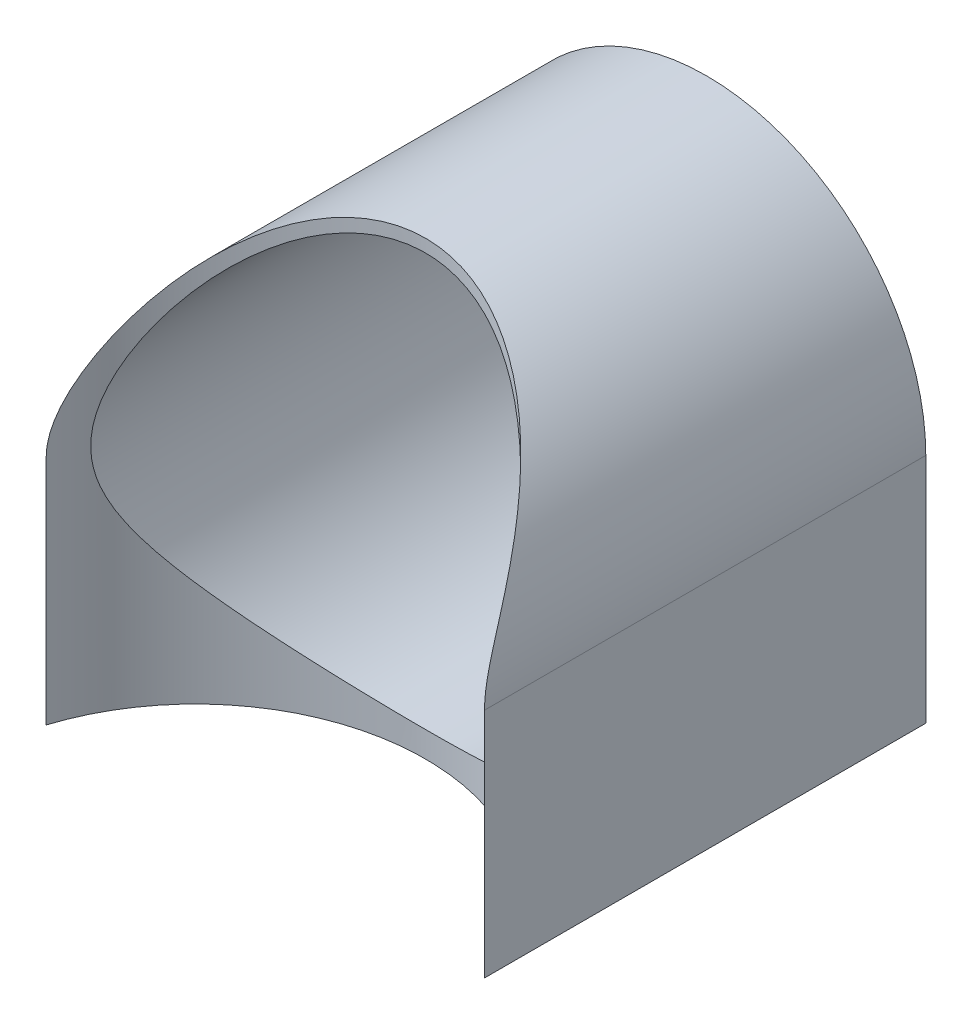
ISO-10303-21;
HEADER;
FILE_DESCRIPTION(('STEP AP214'),'2;1');
FILE_NAME('part.step','',(''),(''),'','','');
FILE_SCHEMA(('AUTOMOTIVE_DESIGN { 1 0 10303 214 1 1 1 1 }'));
ENDSEC;
DATA;
#1=APPLICATION_CONTEXT('core data for automotive mechanical design processes');
#2=APPLICATION_PROTOCOL_DEFINITION('international standard','automotive_design',2000,#1);
#3=PRODUCT_CONTEXT('',#1,'mechanical');
#4=PRODUCT('Part','Part','',(#3));
#5=PRODUCT_RELATED_PRODUCT_CATEGORY('part','',(#4));
#6=PRODUCT_DEFINITION_FORMATION('','',#4);
#7=PRODUCT_DEFINITION_CONTEXT('part definition',#1,'design');
#8=PRODUCT_DEFINITION('design','',#6,#7);
#9=PRODUCT_DEFINITION_SHAPE('','',#8);
#10=(LENGTH_UNIT() NAMED_UNIT(*) SI_UNIT(.MILLI.,.METRE.));
#11=(NAMED_UNIT(*) PLANE_ANGLE_UNIT() SI_UNIT($,.RADIAN.));
#12=(NAMED_UNIT(*) SI_UNIT($,.STERADIAN.) SOLID_ANGLE_UNIT());
#13=UNCERTAINTY_MEASURE_WITH_UNIT(LENGTH_MEASURE(1.E-05),#10,'distance_accuracy_value','');
#14=(GEOMETRIC_REPRESENTATION_CONTEXT(3) GLOBAL_UNCERTAINTY_ASSIGNED_CONTEXT((#13)) GLOBAL_UNIT_ASSIGNED_CONTEXT((#10,
#11,#12)) REPRESENTATION_CONTEXT('',''));
#15=CARTESIAN_POINT('',(0.,0.,0.));
#16=DIRECTION('',(0.,0.,1.));
#17=DIRECTION('',(1.,0.,0.));
#18=AXIS2_PLACEMENT_3D('',#15,#16,#17);
#19=CARTESIAN_POINT('',(-1.14443168743842E-13,200.,-40.));
#20=DIRECTION('',(0.,0.,1.));
#21=DIRECTION('',(1.,0.,0.));
#22=AXIS2_PLACEMENT_3D('',#19,#20,#21);
#23=CYLINDRICAL_SURFACE('',#22,17.15);
#24=CARTESIAN_POINT('',(17.1499999999999,200.,-5.46603146716088));
#25=CARTESIAN_POINT('',(17.1500301504614,200.17550503108,-5.46585820348963));
#26=CARTESIAN_POINT('',(17.1473073338379,200.350892469131,-5.47448055623015));
#27=CARTESIAN_POINT('',(17.1366052620348,200.699506890779,-5.50792974151323));
#28=CARTESIAN_POINT('',(17.1286398467723,200.872738342447,-5.53271390696125));
#29=CARTESIAN_POINT('',(17.1078982303795,201.212799310354,-5.59650277379756));
#30=CARTESIAN_POINT('',(17.0952161020476,201.379687933869,-5.63522895362976));
#31=CARTESIAN_POINT('',(17.0653632964325,201.709780493111,-5.72500058567511));
#32=CARTESIAN_POINT('',(17.0481893966012,201.872981691658,-5.77605488046666));
#33=CARTESIAN_POINT('',(16.9976244489744,202.296302740698,-5.92368412300369));
#34=CARTESIAN_POINT('',(16.9608157008339,202.553053885124,-6.02873344602079));
#35=CARTESIAN_POINT('',(16.8774552692023,203.055993975289,-6.25830923216935));
#36=CARTESIAN_POINT('',(16.8308965001269,203.302175081862,-6.38284984338601));
#37=CARTESIAN_POINT('',(16.7282921213708,203.788020062896,-6.64714870224743));
#38=CARTESIAN_POINT('',(16.6721400810656,204.027571327882,-6.78707059427307));
#39=CARTESIAN_POINT('',(16.5513205707182,204.498369226876,-7.07661081963311));
#40=CARTESIAN_POINT('',(16.4866550253628,204.729617722935,-7.22622695747421));
#41=CARTESIAN_POINT('',(16.3374195381055,205.223862793286,-7.55825610360301));
#42=CARTESIAN_POINT('',(16.251335273163,205.48556026893,-7.7419155833093));
#43=CARTESIAN_POINT('',(16.0682116430272,206.000818062569,-8.11516129909052));
#44=CARTESIAN_POINT('',(15.9711697617362,206.254376494434,-8.30474888912752));
#45=CARTESIAN_POINT('',(15.7661693577766,206.754516834757,-8.68764074997543));
#46=CARTESIAN_POINT('',(15.658202139227,207.001092982791,-8.88094788062044));
#47=CARTESIAN_POINT('',(15.4314148714372,207.487720430748,-9.26941614211496));
#48=CARTESIAN_POINT('',(15.3125937155992,207.727771062127,-9.46457746018401));
#49=CARTESIAN_POINT('',(14.9404506031366,208.437451205375,-10.0496758777982));
#50=CARTESIAN_POINT('',(14.670851119183,208.898062828019,-10.4403619965548));
#51=CARTESIAN_POINT('',(14.0873850868028,209.795621954712,-11.2152111917619));
#52=CARTESIAN_POINT('',(13.7735428005735,210.232582248296,-11.5993777149666));
#53=CARTESIAN_POINT('',(13.149932906865,211.018839281015,-12.2989915396496));
#54=CARTESIAN_POINT('',(12.8464334583406,211.371540544365,-12.6161961180717));
#55=CARTESIAN_POINT('',(12.2052620801522,212.057128872598,-13.2374796489621));
#56=CARTESIAN_POINT('',(11.8675863711357,212.390013739623,-13.5415571444675));
#57=CARTESIAN_POINT('',(11.1578681387376,213.032780070299,-14.132048420786));
#58=CARTESIAN_POINT('',(10.7858758633316,213.342694005734,-14.4184870351052));
#59=CARTESIAN_POINT('',(10.0066052946904,213.936652160861,-14.9698223289901));
#60=CARTESIAN_POINT('',(9.59932402042651,214.220694190866,-15.2347171849811));
#61=CARTESIAN_POINT('',(8.85640233186872,214.691103362309,-15.674851850663));
#62=CARTESIAN_POINT('',(8.52839784334984,214.884105936713,-15.855919909794));
#63=CARTESIAN_POINT('',(7.85342414452189,215.251021546895,-16.2008408195064));
#64=CARTESIAN_POINT('',(7.50646598876309,215.424945535718,-16.3647035453574));
#65=CARTESIAN_POINT('',(6.79436529292097,215.751587700944,-16.6729450491825));
#66=CARTESIAN_POINT('',(6.42922419258325,215.904307552697,-16.8173253664475));
#67=CARTESIAN_POINT('',(5.682180500581,216.186249880258,-17.0842066986034));
#68=CARTESIAN_POINT('',(5.30027764544471,216.315471986549,-17.2067073694229));
#69=CARTESIAN_POINT('',(4.51809062335581,216.549245553196,-17.4285298728929));
#70=CARTESIAN_POINT('',(4.11766534949435,216.653548653115,-17.5276182628131));
#71=CARTESIAN_POINT('',(3.30478337430267,216.833721390033,-17.6988952595702));
#72=CARTESIAN_POINT('',(2.89232661142097,216.909590881541,-17.7710837287648));
#73=CARTESIAN_POINT('',(2.05934678305549,217.031106382084,-17.8867475392941));
#74=CARTESIAN_POINT('',(1.63883081961655,217.076777846647,-17.9302470639924));
#75=CARTESIAN_POINT('',(0.793581468405215,217.136865199458,-17.9874835225415));
#76=CARTESIAN_POINT('',(0.368848747766456,217.151285955149,-18.0012250913321));
#77=CARTESIAN_POINT('',(-0.418904170808787,217.148732022657,-17.9987920175735));
#78=CARTESIAN_POINT('',(-0.781963105135389,217.135997410673,-17.9866576696267));
#79=CARTESIAN_POINT('',(-1.50513138196818,217.087666899511,-17.9406188597214));
#80=CARTESIAN_POINT('',(-1.86524106282839,217.052073661086,-17.9067169315173));
#81=CARTESIAN_POINT('',(-2.5799166616478,216.95866836009,-17.817792482043));
#82=CARTESIAN_POINT('',(-2.93448237142188,216.900855465209,-17.7627691696035));
#83=CARTESIAN_POINT('',(-3.63572511629653,216.763998218859,-17.63260303595));
#84=CARTESIAN_POINT('',(-3.98240182076349,216.684952979298,-17.5574593731573));
#85=CARTESIAN_POINT('',(-4.66107351800639,216.508123976555,-17.3895055541766));
#86=CARTESIAN_POINT('',(-4.99320593958901,216.410617345956,-17.2969567968855));
#87=CARTESIAN_POINT('',(-5.64628141690345,216.197530543643,-17.0949217326432));
#88=CARTESIAN_POINT('',(-5.96722496316804,216.08195116548,-16.9854361693676));
#89=CARTESIAN_POINT('',(-6.59678821071979,215.834119599123,-16.7509769916218));
#90=CARTESIAN_POINT('',(-6.90540677561849,215.701865878173,-16.6260019533296));
#91=CARTESIAN_POINT('',(-7.50948061430361,215.422096298202,-16.3620416618556));
#92=CARTESIAN_POINT('',(-7.804933093127,215.274577220447,-16.2230534541256));
#93=CARTESIAN_POINT('',(-8.5184142103262,214.8926598803,-15.8638841919972));
#94=CARTESIAN_POINT('',(-8.92843486343411,214.650133557504,-15.6363578535175));
#95=CARTESIAN_POINT('',(-9.71773333740213,214.138934012689,-15.1584535853747));
#96=CARTESIAN_POINT('',(-10.0969992648008,213.870250762823,-14.9080668939867));
#97=CARTESIAN_POINT('',(-10.8254848998188,213.309514830454,-14.3878314116819));
#98=CARTESIAN_POINT('',(-11.1746259855629,213.017404621039,-14.1179348834483));
#99=CARTESIAN_POINT('',(-11.8420820171811,212.413308163205,-13.5629457513853));
#100=CARTESIAN_POINT('',(-12.1603983155844,212.101322787865,-13.2778538151515));
#101=CARTESIAN_POINT('',(-12.8696028854966,211.351000294735,-12.597216911677));
#102=CARTESIAN_POINT('',(-13.2485682098839,210.905650102289,-12.1969588277385));
#103=CARTESIAN_POINT('',(-13.9543961021646,209.986662672306,-11.382666540298));
#104=CARTESIAN_POINT('',(-14.2812278009152,209.513008902234,-10.9686243490766));
#105=CARTESIAN_POINT('',(-14.7332025726162,208.782763556997,-10.3440216873912));
#106=CARTESIAN_POINT('',(-14.8774215585284,208.536178278721,-10.1353326258167));
#107=CARTESIAN_POINT('',(-15.1533637590106,208.036146036567,-9.71792738931835));
#108=CARTESIAN_POINT('',(-15.2850881089948,207.782699698862,-9.50921121858726));
#109=CARTESIAN_POINT('',(-15.5360697179478,207.268753062812,-9.09337543574791));
#110=CARTESIAN_POINT('',(-15.6553351416071,207.008257526748,-8.88625486149515));
#111=CARTESIAN_POINT('',(-15.8815159917121,206.47940426531,-8.47539888067228));
#112=CARTESIAN_POINT('',(-15.9884335106024,206.211047881707,-8.27166290558107));
#113=CARTESIAN_POINT('',(-16.167992325446,205.7245406313,-7.9137206160026));
#114=CARTESIAN_POINT('',(-16.2430375841078,205.508128186126,-7.75835796683701));
#115=CARTESIAN_POINT('',(-16.3853853076625,205.069017913443,-7.4530199991898));
#116=CARTESIAN_POINT('',(-16.4526876294272,204.846319969841,-7.30304478032995));
#117=CARTESIAN_POINT('',(-16.5793262388336,204.393596685959,-7.01079676540555));
#118=CARTESIAN_POINT('',(-16.6386612757424,204.163570202215,-6.86852518077198));
#119=CARTESIAN_POINT('',(-16.7489178056817,203.695155079977,-6.59511337111281));
#120=CARTESIAN_POINT('',(-16.7998417833179,203.456768936221,-6.4639698644672));
#121=CARTESIAN_POINT('',(-16.9106775834622,202.875692452873,-6.16945104853925));
#122=CARTESIAN_POINT('',(-16.9664397937749,202.528342077575,-6.01324571082945));
#123=CARTESIAN_POINT('',(-17.0347762289169,201.992744652388,-5.81561455145237));
#124=CARTESIAN_POINT('',(-17.0549758861365,201.812200462479,-5.755942444063));
#125=CARTESIAN_POINT('',(-17.0898856592926,201.446392799758,-5.65144245000309));
#126=CARTESIAN_POINT('',(-17.1045996541757,201.261132760956,-5.60660407684169));
#127=CARTESIAN_POINT('',(-17.1273885238561,200.897830232636,-5.5365991697711));
#128=CARTESIAN_POINT('',(-17.1358036006261,200.720005942427,-5.51042892065503));
#129=CARTESIAN_POINT('',(-17.1471415772196,200.36150894143,-5.47500084474368));
#130=CARTESIAN_POINT('',(-17.1500330487483,200.180825794404,-5.46583980544311));
#131=CARTESIAN_POINT('',(-17.1500000000001,200.,-5.46603146716074));
#132=B_SPLINE_CURVE_WITH_KNOTS('',3,(#24,#25,#26,#27,#28,#29,#30,#31,#32,#33,#34,#35,#36,#37,
#38,#39,#40,#41,#42,#43,#44,#45,#46,#47,#48,#49,#50,#51,#52,#53,#54,#55,#56,#57,#58,#59,#60,#61,
#62,#63,#64,#65,#66,#67,#68,#69,#70,#71,#72,#73,#74,#75,#76,#77,#78,#79,#80,#81,#82,#83,#84,#85,
#86,#87,#88,#89,#90,#91,#92,#93,#94,#95,#96,#97,#98,#99,#100,#101,#102,#103,#104,#105,#106,#107,
#108,#109,#110,#111,#112,#113,#114,#115,#116,#117,#118,#119,#120,#121,#122,#123,#124,#125,#126,
#127,#128,#129,#130,#131),.UNSPECIFIED.,.F.,.F.,(4,2,2,2,2,2,2,2,2,2,2,2,2,2,2,2,2,2,2,2,2,2,2,
2,2,2,2,2,2,2,2,2,2,2,2,2,2,2,2,2,2,2,2,2,2,2,2,2,2,2,2,2,2,4),(0.,0.526094496368786,
1.05080569856248,1.56556869674708,2.0807020211433,2.91871669081147,3.7573424933711,
4.60596099665031,5.45438797727209,6.44728595046231,7.44041237918728,8.43433558621979,
9.42836024062126,11.4106084660826,13.3917738498483,15.0797979185714,16.7680088603634,
18.4537859332432,20.139705550788,21.402984683609,22.6655347278028,23.9279849603609,
25.1904550440141,26.4650268508605,27.7396051793898,29.0131077234247,30.2864118992588,
31.3755111251472,32.4644836024596,33.5534968747184,34.6425557045193,35.7164040807051,
36.7902053188253,37.8641053361017,38.9382322507197,40.5196344519078,42.1016453246977,
43.6876674590623,45.2736199704293,47.39658561073,49.5208036633443,50.5818874559442,
51.6428747330494,52.7031622945557,53.763269917965,54.5933920355886,55.4235294955381,
56.2537971214448,57.0838190480473,58.2350887820175,58.8081841572063,59.3808735209493,
59.9198076944663,60.4617992756102),.UNSPECIFIED.);
#133=CARTESIAN_POINT('',(17.1499999999999,200.,-5.46603146716089));
#134=VERTEX_POINT('',#133);
#135=CARTESIAN_POINT('',(-17.1500000000001,200.,-5.46603146716075));
#136=VERTEX_POINT('',#135);
#137=EDGE_CURVE('E82',#134,#136,#132,.T.);
#138=ORIENTED_EDGE('',*,*,#137,.F.);
#139=DIRECTION('',(0.,0.,-1.));
#140=VECTOR('',#139,1.);
#141=CARTESIAN_POINT('',(17.1499999999999,200.,0.));
#142=LINE('',#141,#140);
#143=CARTESIAN_POINT('',(17.1499999999999,200.,-40.));
#144=VERTEX_POINT('',#143);
#145=EDGE_CURVE('E99',#134,#144,#142,.T.);
#146=ORIENTED_EDGE('',*,*,#145,.T.);
#147=CARTESIAN_POINT('',(-1.14443168743842E-13,200.,-40.));
#148=DIRECTION('',(0.,0.,1.));
#149=DIRECTION('',(1.,0.,0.));
#150=AXIS2_PLACEMENT_3D('',#147,#148,#149);
#151=CIRCLE('',#150,17.15);
#152=CARTESIAN_POINT('',(-17.1500000000001,200.,-40.));
#153=VERTEX_POINT('',#152);
#154=EDGE_CURVE('E47',#144,#153,#151,.T.);
#155=ORIENTED_EDGE('',*,*,#154,.T.);
#156=DIRECTION('',(0.,0.,-1.));
#157=VECTOR('',#156,1.);
#158=CARTESIAN_POINT('',(-17.1500000000001,200.,0.));
#159=LINE('',#158,#157);
#160=EDGE_CURVE('E106',#136,#153,#159,.T.);
#161=ORIENTED_EDGE('',*,*,#160,.F.);
#162=EDGE_LOOP('',(#138,#146,#155,#161));
#163=FACE_BOUND('',#162,.T.);
#164=ADVANCED_FACE('F39',(#163),#23,.T.);
#165=CARTESIAN_POINT('',(-1.14443168743842E-13,200.,-40.));
#166=DIRECTION('',(0.,0.,1.));
#167=DIRECTION('',(1.,0.,0.));
#168=AXIS2_PLACEMENT_3D('',#165,#166,#167);
#169=PLANE('',#168);
#170=CARTESIAN_POINT('',(-1.14443168743842E-13,200.,-40.));
#171=DIRECTION('',(0.,0.,1.));
#172=DIRECTION('',(1.,0.,0.));
#173=AXIS2_PLACEMENT_3D('',#170,#171,#172);
#174=CIRCLE('',#173,16.15);
#175=CARTESIAN_POINT('',(16.1499999999999,200.,-40.));
#176=VERTEX_POINT('',#175);
#177=EDGE_CURVE('E95',#176,#176,#174,.T.);
#178=ORIENTED_EDGE('',*,*,#177,.T.);
#179=EDGE_LOOP('',(#178));
#180=FACE_BOUND('',#179,.T.);
#181=ORIENTED_EDGE('',*,*,#154,.F.);
#182=DIRECTION('',(0.,-1.,0.));
#183=VECTOR('',#182,1.);
#184=CARTESIAN_POINT('',(17.1499999999999,0.,-40.));
#185=LINE('',#184,#183);
#186=CARTESIAN_POINT('',(17.1499999999999,181.85,-40.));
#187=VERTEX_POINT('',#186);
#188=EDGE_CURVE('E115',#144,#187,#185,.T.);
#189=ORIENTED_EDGE('',*,*,#188,.T.);
#190=DIRECTION('',(-1.,0.,0.));
#191=VECTOR('',#190,1.);
#192=CARTESIAN_POINT('',(0.,181.85,-40.));
#193=LINE('',#192,#191);
#194=CARTESIAN_POINT('',(-17.1500000000001,181.85,-40.));
#195=VERTEX_POINT('',#194);
#196=EDGE_CURVE('E102',#187,#195,#193,.T.);
#197=ORIENTED_EDGE('',*,*,#196,.T.);
#198=DIRECTION('',(0.,-1.,0.));
#199=VECTOR('',#198,1.);
#200=CARTESIAN_POINT('',(-17.1500000000001,0.,-40.));
#201=LINE('',#200,#199);
#202=EDGE_CURVE('E93',#153,#195,#201,.T.);
#203=ORIENTED_EDGE('',*,*,#202,.F.);
#204=EDGE_LOOP('',(#181,#189,#197,#203));
#205=FACE_BOUND('',#204,.T.);
#206=ADVANCED_FACE('F114',(#180,#205),#169,.F.);
#207=CARTESIAN_POINT('',(-1.14443168743842E-13,200.,-40.));
#208=DIRECTION('',(0.,0.,1.));
#209=DIRECTION('',(1.,0.,0.));
#210=AXIS2_PLACEMENT_3D('',#207,#208,#209);
#211=CYLINDRICAL_SURFACE('',#210,16.15);
#212=CARTESIAN_POINT('',(16.1499999999999,200.,-7.94842751743949));
#213=CARTESIAN_POINT('',(16.1499973890662,200.24405733004,-7.94843652800087));
#214=CARTESIAN_POINT('',(16.1444484367888,200.488173394009,-7.95973830317902));
#215=CARTESIAN_POINT('',(16.1224392623488,200.97400249163,-8.00421979514565));
#216=CARTESIAN_POINT('',(16.1059715629709,201.215713763255,-8.03741450424773));
#217=CARTESIAN_POINT('',(16.0625814307562,201.695333981874,-8.12377970164535));
#218=CARTESIAN_POINT('',(16.0356257688888,201.933228316012,-8.17701366274153));
#219=CARTESIAN_POINT('',(15.9719567554523,202.40320581868,-8.30068826998425));
#220=CARTESIAN_POINT('',(15.9352384541001,202.635285973849,-8.37113764309483));
#221=CARTESIAN_POINT('',(15.8331244621662,203.20195593459,-8.5632303377792));
#222=CARTESIAN_POINT('',(15.7623991797507,203.532730915953,-8.69327640523069));
#223=CARTESIAN_POINT('',(15.6032247804508,204.180091772408,-8.97583884525789));
#224=CARTESIAN_POINT('',(15.5147636284566,204.496667832998,-9.1283704572441));
#225=CARTESIAN_POINT('',(15.3212240683984,205.117481304167,-9.44962360064633));
#226=CARTESIAN_POINT('',(15.2160942158222,205.421676726485,-9.61839459586786));
#227=CARTESIAN_POINT('',(14.990325887331,206.017824335913,-9.96660437177266));
#228=CARTESIAN_POINT('',(14.8696894262999,206.309778107142,-10.1460417648696));
#229=CARTESIAN_POINT('',(14.6328793176668,206.839013476166,-10.4840231101141));
#230=CARTESIAN_POINT('',(14.5188115063509,207.077863118153,-10.6416002787688));
#231=CARTESIAN_POINT('',(14.2800356273868,207.548018180642,-10.9599367912246));
#232=CARTESIAN_POINT('',(14.155326336138,207.779322729342,-11.1206964993304));
#233=CARTESIAN_POINT('',(13.7652278552466,208.462652968475,-11.605619832385));
#234=CARTESIAN_POINT('',(13.4839388853289,208.903937717915,-11.9323246863619));
#235=CARTESIAN_POINT('',(12.8793096813723,209.758032319646,-12.5825508894699));
#236=CARTESIAN_POINT('',(12.5560177042018,210.170874029498,-12.9060754405182));
#237=CARTESIAN_POINT('',(11.866506270916,210.967487375023,-13.5427491611205));
#238=CARTESIAN_POINT('',(11.5003080433774,211.351273233123,-13.8559033640252));
#239=CARTESIAN_POINT('',(10.8179212078492,211.998316270896,-14.3914106542212));
#240=CARTESIAN_POINT('',(10.5109831097171,212.268313025946,-14.6174424845204));
#241=CARTESIAN_POINT('',(9.87177630117274,212.788285282661,-15.056504317356));
#242=CARTESIAN_POINT('',(9.53950805438846,213.038261150605,-15.2695345577373));
#243=CARTESIAN_POINT('',(8.85027458414863,213.515568984923,-15.6790662956069));
#244=CARTESIAN_POINT('',(8.49334445321267,213.742932047629,-15.8755904321711));
#245=CARTESIAN_POINT('',(7.75500102059716,214.172677732724,-16.2490304902171));
#246=CARTESIAN_POINT('',(7.37359297166456,214.375065687487,-16.4259505964812));
#247=CARTESIAN_POINT('',(6.66420850805926,214.715092952103,-16.7244191412325));
#248=CARTESIAN_POINT('',(6.34030264515965,214.85766442491,-16.8500395698979));
#249=CARTESIAN_POINT('',(5.67857432592584,215.122939244424,-17.0844060035739));
#250=CARTESIAN_POINT('',(5.34075485103164,215.245646820112,-17.1931556001418));
#251=CARTESIAN_POINT('',(4.65278454224986,215.469482521423,-17.3919448106216));
#252=CARTESIAN_POINT('',(4.30263787614377,215.570617860448,-17.481990678488));
#253=CARTESIAN_POINT('',(3.591897531323,215.749763853384,-17.6417379205673));
#254=CARTESIAN_POINT('',(3.2313037389874,215.82777425569,-17.7114390734236));
#255=CARTESIAN_POINT('',(2.49995472124928,215.959686812815,-17.829420245602));
#256=CARTESIAN_POINT('',(2.12915140764485,216.01344107582,-17.8775688432145));
#257=CARTESIAN_POINT('',(1.3824300556401,216.095106004775,-17.9507550866978));
#258=CARTESIAN_POINT('',(1.00651200476603,216.123016607688,-17.9757926761956));
#259=CARTESIAN_POINT('',(0.252903523001927,216.152420996702,-18.0021710316166));
#260=CARTESIAN_POINT('',(-0.124786448290476,216.153921291024,-18.003517635644));
#261=CARTESIAN_POINT('',(-0.87866305865771,216.130488090127,-17.9824947732038));
#262=CARTESIAN_POINT('',(-1.25484979563887,216.105556345563,-17.9601268774022));
#263=CARTESIAN_POINT('',(-1.96657135121135,216.033418950954,-17.8954686336045));
#264=CARTESIAN_POINT('',(-2.30254413013812,215.988579382819,-17.8552952080604));
#265=CARTESIAN_POINT('',(-2.96837434451241,215.878447752377,-17.7567451495962));
#266=CARTESIAN_POINT('',(-3.29823225439978,215.813157283907,-17.6983699352302));
#267=CARTESIAN_POINT('',(-3.94993992114965,215.663087729203,-17.5644149822248));
#268=CARTESIAN_POINT('',(-4.27178868673643,215.578306243771,-17.4888331255867));
#269=CARTESIAN_POINT('',(-4.90582512830606,215.390410304779,-17.3216739759259));
#270=CARTESIAN_POINT('',(-5.21801221745122,215.287294740188,-17.2300957135381));
#271=CARTESIAN_POINT('',(-5.84877807807459,215.057663556989,-17.0266771245036));
#272=CARTESIAN_POINT('',(-6.1667187843434,214.93015394391,-16.9139834357202));
#273=CARTESIAN_POINT('',(-6.78919358252473,214.657585657868,-16.6738764952501));
#274=CARTESIAN_POINT('',(-7.09372755615107,214.512526830113,-16.5464631137291));
#275=CARTESIAN_POINT('',(-7.688618439746,214.206321455607,-16.2785615908719));
#276=CARTESIAN_POINT('',(-7.97897461790999,214.045174079729,-16.1380727757163));
#277=CARTESIAN_POINT('',(-8.54502806290079,213.708156088389,-15.8456314410198));
#278=CARTESIAN_POINT('',(-8.82072222088274,213.532282370634,-15.6936765066641));
#279=CARTESIAN_POINT('',(-9.49801310872798,213.071156385709,-15.2974593406606));
#280=CARTESIAN_POINT('',(-9.88972152826931,212.776955094079,-15.0466179284663));
#281=CARTESIAN_POINT('',(-10.6381330664942,212.160911412572,-14.5271404709939));
#282=CARTESIAN_POINT('',(-10.9948199577307,211.839056337443,-14.2584962723433));
#283=CARTESIAN_POINT('',(-11.6746556938052,211.169309031837,-13.7074629644485));
#284=CARTESIAN_POINT('',(-11.9976732925066,210.821323386464,-13.4250259398323));
#285=CARTESIAN_POINT('',(-12.6090810960256,210.102290987179,-12.8524860906749));
#286=CARTESIAN_POINT('',(-12.8974791797689,209.731249509743,-12.5623850287701));
#287=CARTESIAN_POINT('',(-13.4467620619539,208.957546179272,-11.9729169637598));
#288=CARTESIAN_POINT('',(-13.7068168993428,208.554337983412,-11.6734950752368));
#289=CARTESIAN_POINT('',(-14.1916146689973,207.723484854905,-11.0790326037376));
#290=CARTESIAN_POINT('',(-14.4163336914583,207.295823640797,-10.7839951086334));
#291=CARTESIAN_POINT('',(-14.7258451096715,206.635557741483,-10.3528148971621));
#292=CARTESIAN_POINT('',(-14.8242559347809,206.412792371075,-10.2112490485231));
#293=CARTESIAN_POINT('',(-15.0119362105609,205.960228209022,-9.93326976581384));
#294=CARTESIAN_POINT('',(-15.101204702012,205.730428682627,-9.7968568733408));
#295=CARTESIAN_POINT('',(-15.2701709028419,205.263639899513,-9.5313490417616));
#296=CARTESIAN_POINT('',(-15.3498814590372,205.026660842232,-9.40224440577741));
#297=CARTESIAN_POINT('',(-15.4994089259613,204.544717467951,-9.15365176703279));
#298=CARTESIAN_POINT('',(-15.5692290628781,204.299755787048,-9.03416063393296));
#299=CARTESIAN_POINT('',(-15.688361283664,203.839939654714,-8.8253871428484));
#300=CARTESIAN_POINT('',(-15.7391747499011,203.626301240523,-8.73429281975032));
#301=CARTESIAN_POINT('',(-15.8328018049551,203.192811343079,-8.56340345633905));
#302=CARTESIAN_POINT('',(-15.8756160695652,202.972960386487,-8.48360746165193));
#303=CARTESIAN_POINT('',(-15.9525514884291,202.527744141717,-8.33803781703634));
#304=CARTESIAN_POINT('',(-15.9866940403797,202.302393960812,-8.27222971840845));
#305=CARTESIAN_POINT('',(-16.0457559750095,201.84635838592,-8.15707781542545));
#306=CARTESIAN_POINT('',(-16.0706783772829,201.615674764977,-8.10772862131022));
#307=CARTESIAN_POINT('',(-16.1109811867331,201.146715269727,-8.02735082917883));
#308=CARTESIAN_POINT('',(-16.1262150481523,200.908377569067,-7.99660392608762));
#309=CARTESIAN_POINT('',(-16.146066696014,200.429468098569,-7.95644691132897));
#310=CARTESIAN_POINT('',(-16.1506858166555,200.188896613318,-7.94703411811445));
#311=CARTESIAN_POINT('',(-16.1491492268147,199.70787467461,-7.95015607903425));
#312=CARTESIAN_POINT('',(-16.1429909688692,199.467424263209,-7.96269602216613));
#313=CARTESIAN_POINT('',(-16.1201089411755,198.989078342385,-8.00891579967198));
#314=CARTESIAN_POINT('',(-16.1033833732226,198.751183274803,-8.04259923195828));
#315=CARTESIAN_POINT('',(-16.057347939012,198.252465490691,-8.13415538696803));
#316=CARTESIAN_POINT('',(-16.0268005654242,197.992194648206,-8.19438606788321));
#317=CARTESIAN_POINT('',(-15.9540917579478,197.478729690204,-8.33505815277271));
#318=CARTESIAN_POINT('',(-15.911920969733,197.22554145619,-8.41551583048592));
#319=CARTESIAN_POINT('',(-15.816759970148,196.726251645874,-8.59303512916852));
#320=CARTESIAN_POINT('',(-15.7637343319835,196.480176364005,-8.69015094437807));
#321=CARTESIAN_POINT('',(-15.6477752133228,195.996056753487,-8.89726126229061));
#322=CARTESIAN_POINT('',(-15.5848437035091,195.758010838883,-9.00725320229317));
#323=CARTESIAN_POINT('',(-15.3929114969556,195.092625100055,-9.33370973825826));
#324=CARTESIAN_POINT('',(-15.2528213145635,194.674265672604,-9.56199284104805));
#325=CARTESIAN_POINT('',(-14.9436668363423,193.860041873955,-10.0383159290622));
#326=CARTESIAN_POINT('',(-14.7745782742886,193.464196715445,-10.286372367069));
#327=CARTESIAN_POINT('',(-14.408339228769,192.692128696147,-10.7934124122601));
#328=CARTESIAN_POINT('',(-14.2111481968533,192.315935281329,-11.0524114215829));
#329=CARTESIAN_POINT('',(-13.789340258733,191.582429823495,-11.5744011297611));
#330=CARTESIAN_POINT('',(-13.564731650431,191.225112114442,-11.8373905999105));
#331=CARTESIAN_POINT('',(-13.0640054888374,190.493691196058,-12.3888684560053));
#332=CARTESIAN_POINT('',(-12.7849806103133,190.121503837995,-12.6772663070264));
#333=CARTESIAN_POINT('',(-12.1930643828427,189.399549208632,-13.2475725235844));
#334=CARTESIAN_POINT('',(-11.880166401137,189.049786349744,-13.5294796049979));
#335=CARTESIAN_POINT('',(-11.2206335384944,188.374938613501,-14.0812618313208));
#336=CARTESIAN_POINT('',(-10.8740624706751,188.049809058548,-14.3511583740469));
#337=CARTESIAN_POINT('',(-10.1463851296095,187.426105173198,-14.8745286622631));
#338=CARTESIAN_POINT('',(-9.7652900358971,187.127522308097,-15.1280076787853));
#339=CARTESIAN_POINT('',(-9.0635177758993,186.627867752629,-15.5556736955093));
#340=CARTESIAN_POINT('',(-8.75005420005618,186.420503656592,-15.7343719736052));
#341=CARTESIAN_POINT('',(-8.10350288557062,186.025048180073,-16.076909257864));
#342=CARTESIAN_POINT('',(-7.77041986496256,185.836952195606,-16.2407518126225));
#343=CARTESIAN_POINT('',(-7.08532839591035,185.482100406978,-16.5511182714767));
#344=CARTESIAN_POINT('',(-6.73332137911634,185.315342991716,-16.6976434830002));
#345=CARTESIAN_POINT('',(-6.01158639965548,185.005416355767,-16.9708481034942));
#346=CARTESIAN_POINT('',(-5.64185817646968,184.862247481992,-17.0975272205908));
#347=CARTESIAN_POINT('',(-4.88272772028814,184.60051120055,-17.3296874052072));
#348=CARTESIAN_POINT('',(-4.49316425916544,184.482207405676,-17.4349409890417));
#349=CARTESIAN_POINT('',(-3.70053047021581,184.274339413192,-17.6202065171587));
#350=CARTESIAN_POINT('',(-3.29746003917321,184.184775435258,-17.7002182685032));
#351=CARTESIAN_POINT('',(-2.48166467921935,184.036431043039,-17.8328890779661));
#352=CARTESIAN_POINT('',(-2.06894989867822,183.977619669194,-17.8855756447226));
#353=CARTESIAN_POINT('',(-1.23759043710168,183.89207079229,-17.9622526164505));
#354=CARTESIAN_POINT('',(-0.818946829421754,183.865327556857,-17.986248150116));
#355=CARTESIAN_POINT('',(-0.0435552519644835,183.846128649795,-18.003473388192));
#356=CARTESIAN_POINT('',(0.31300155911744,183.849108618606,-18.0007986584888));
#357=CARTESIAN_POINT('',(1.02432507301965,183.878588124745,-17.9743532868413));
#358=CARTESIAN_POINT('',(1.3790919855618,183.905084839083,-17.9505851769809));
#359=CARTESIAN_POINT('',(2.08411460057572,183.981114386679,-17.8824470722295));
#360=CARTESIAN_POINT('',(2.43437046560644,184.030646387442,-17.8380778218629));
#361=CARTESIAN_POINT('',(3.12791030590525,184.15188934182,-17.7296186542886));
#362=CARTESIAN_POINT('',(3.47119406657275,184.223600977023,-17.66552813104));
#363=CARTESIAN_POINT('',(4.13702903462628,184.385236552384,-17.5213313411315));
#364=CARTESIAN_POINT('',(4.4598878541878,184.474454407182,-17.4418472001546));
#365=CARTESIAN_POINT('',(5.09545220035758,184.671283708256,-17.2668761477441));
#366=CARTESIAN_POINT('',(5.40815831506267,184.778894086872,-17.1713901652007));
#367=CARTESIAN_POINT('',(6.02224791593303,185.011243063202,-16.9657716003501));
#368=CARTESIAN_POINT('',(6.32362872780691,185.135985674452,-16.8556355861973));
#369=CARTESIAN_POINT('',(6.91409144218188,185.401279138203,-16.6221595132583));
#370=CARTESIAN_POINT('',(7.20317080429461,185.541833234327,-16.4988167454428));
#371=CARTESIAN_POINT('',(7.89133081618496,185.901814705725,-16.1841184060845));
#372=CARTESIAN_POINT('',(8.2835548705013,186.128953733053,-15.9865184979674));
#373=CARTESIAN_POINT('',(9.04015092637271,186.609732696631,-15.5711939915441));
#374=CARTESIAN_POINT('',(9.40451246853331,186.863382501097,-15.353461902857));
#375=CARTESIAN_POINT('',(10.1055139368021,187.394650397328,-14.9014363809727));
#376=CARTESIAN_POINT('',(10.4421044637938,187.672309474031,-14.6671147573364));
#377=CARTESIAN_POINT('',(11.0868744178561,188.248797937068,-14.1860145065484));
#378=CARTESIAN_POINT('',(11.3950568257165,188.547625096459,-13.9392371905548));
#379=CARTESIAN_POINT('',(11.9894247615361,189.171080085422,-13.4316612850076));
#380=CARTESIAN_POINT('',(12.2750279436175,189.496111987183,-13.1706787546379));
#381=CARTESIAN_POINT('',(12.8174774760126,190.16534893601,-12.6433905054205));
#382=CARTESIAN_POINT('',(13.0743198768528,190.509556606626,-12.377084061388));
#383=CARTESIAN_POINT('',(13.5593375001899,191.216464768345,-11.8437395175257));
#384=CARTESIAN_POINT('',(13.7875362499761,191.579149733715,-11.5767022047105));
#385=CARTESIAN_POINT('',(14.2155622579913,192.323755065144,-11.0468800507493));
#386=CARTESIAN_POINT('',(14.4153980709596,192.705669583962,-10.7840939486451));
#387=CARTESIAN_POINT('',(14.7183505645069,193.3465678825,-10.3639099034113));
#388=CARTESIAN_POINT('',(14.8300779692819,193.599323701892,-10.2031754754647));
#389=CARTESIAN_POINT('',(15.0417101591539,194.113842938092,-9.88852116928615));
#390=CARTESIAN_POINT('',(15.1416172492076,194.375604585875,-9.73459996615402));
#391=CARTESIAN_POINT('',(15.3291583513777,194.908900357981,-9.43651983158133));
#392=CARTESIAN_POINT('',(15.4167938515003,195.180433292448,-9.29235971764496));
#393=CARTESIAN_POINT('',(15.5790753214353,195.734078594866,-9.01764012628587));
#394=CARTESIAN_POINT('',(15.6537249367208,196.016187966619,-8.88707683602781));
#395=CARTESIAN_POINT('',(15.7722811654063,196.520469212624,-8.67445197172777));
#396=CARTESIAN_POINT('',(15.8192265496788,196.740228586342,-8.58837718853247));
#397=CARTESIAN_POINT('',(15.904592256138,197.186113506408,-8.42924075246561));
#398=CARTESIAN_POINT('',(15.9430118791551,197.412239573156,-8.35618016694234));
#399=CARTESIAN_POINT('',(16.0105366823168,197.869632090183,-8.22606136681262));
#400=CARTESIAN_POINT('',(16.0396725555812,198.100878840583,-8.16895049966828));
#401=CARTESIAN_POINT('',(16.0881071158583,198.568089262067,-8.07314830096892));
#402=CARTESIAN_POINT('',(16.107412815452,198.804049445482,-8.0344438400848));
#403=CARTESIAN_POINT('',(16.1309754093887,199.200329490143,-7.98699347032756));
#404=CARTESIAN_POINT('',(16.1380988152371,199.359816150188,-7.97257080782855));
#405=CARTESIAN_POINT('',(16.1476122326224,199.67952671249,-7.95328433823448));
#406=CARTESIAN_POINT('',(16.1500017143524,199.839750695255,-7.94842160105831));
#407=CARTESIAN_POINT('',(16.1499999999999,200.,-7.94842751743949));
#408=B_SPLINE_CURVE_WITH_KNOTS('',3,(#212,#213,#214,#215,#216,#217,#218,#219,#220,#221,#222,
#223,#224,#225,#226,#227,#228,#229,#230,#231,#232,#233,#234,#235,#236,#237,#238,#239,#240,#241,
#242,#243,#244,#245,#246,#247,#248,#249,#250,#251,#252,#253,#254,#255,#256,#257,#258,#259,#260,
#261,#262,#263,#264,#265,#266,#267,#268,#269,#270,#271,#272,#273,#274,#275,#276,#277,#278,#279,
#280,#281,#282,#283,#284,#285,#286,#287,#288,#289,#290,#291,#292,#293,#294,#295,#296,#297,#298,
#299,#300,#301,#302,#303,#304,#305,#306,#307,#308,#309,#310,#311,#312,#313,#314,#315,#316,#317,
#318,#319,#320,#321,#322,#323,#324,#325,#326,#327,#328,#329,#330,#331,#332,#333,#334,#335,#336,
#337,#338,#339,#340,#341,#342,#343,#344,#345,#346,#347,#348,#349,#350,#351,#352,#353,#354,#355,
#356,#357,#358,#359,#360,#361,#362,#363,#364,#365,#366,#367,#368,#369,#370,#371,#372,#373,#374,
#375,#376,#377,#378,#379,#380,#381,#382,#383,#384,#385,#386,#387,#388,#389,#390,#391,#392,#393,
#394,#395,#396,#397,#398,#399,#400,#401,#402,#403,#404,#405,#406,#407),.UNSPECIFIED.,.T.,.F.,(4,
2,2,2,2,2,2,2,2,2,2,2,2,2,2,2,2,2,2,2,2,2,2,2,2,2,2,2,2,2,2,2,2,2,2,2,2,2,2,2,2,2,2,2,2,2,2,2,2,
2,2,2,2,2,2,2,2,2,2,2,2,2,2,2,2,2,2,2,2,2,2,2,2,2,2,2,2,2,2,2,2,2,2,2,2,2,2,2,2,2,2,2,2,2,2,2,2,
4),(0.,0.73196110715344,1.46442398353755,2.19922667256847,2.93440262876198,4.01968134100935,
5.10569900358039,6.19513612811244,7.28443183716631,8.20825611680346,9.13218676500888,
10.9806494141561,12.8270068567379,14.6724546106395,16.0726586460468,17.4728370591037,
18.8710625710895,20.2689890329439,21.3945153041164,22.5198016371623,23.6447111010441,
24.7696328038209,25.9013235278017,27.0330170122268,28.1644316126344,29.2957712815267,
30.3185852924886,31.341319610482,32.3641798869408,33.3871021691594,34.4679121112859,
35.5487315873734,36.6296067924627,37.7107102733748,39.3593861966945,41.0088224746115,
42.6644652042647,44.319730415129,46.0148629897133,47.7111376769607,48.5559884974651,
49.4009278696453,50.2447185170448,51.0882332886878,51.8010501542368,52.5138067719176,
53.2247871710988,53.9355345180179,54.6567916070547,55.3779580341358,56.0992949473037,
56.8207546410961,57.6261348926505,58.4321652026116,59.2408693255238,60.0494127670071,
61.5372174637819,63.0262733048194,64.517499844175,66.0082761790704,67.6487073569213,
69.2894603338402,70.927162451255,72.5643361324738,73.8117771481391,75.0589193974521,
76.3059674295787,77.5530338001497,78.8127197296891,80.072415287515,81.3308402188595,
82.5890401655634,83.6574098315347,84.725651266008,85.7938540972875,86.8620897580553,
87.8938219026075,88.925494176923,89.9574085528213,90.9895350066536,92.4706810561823,
93.9523804156768,95.436661017244,96.9207856994151,98.4354161564761,99.9502543504557,
101.463840030982,102.976968213982,103.935704008813,104.894252541331,105.852684743068,
106.810847452416,107.532273396535,108.25375848057,108.972832890436,109.691393610782,
110.171949278845,110.652558726233),.UNSPECIFIED.);
#409=CARTESIAN_POINT('',(16.1499999999999,200.,-7.94842751743949));
#410=VERTEX_POINT('',#409);
#411=EDGE_CURVE('E85',#410,#410,#408,.T.);
#412=ORIENTED_EDGE('',*,*,#411,.T.);
#413=EDGE_LOOP('',(#412));
#414=FACE_BOUND('',#413,.T.);
#415=ORIENTED_EDGE('',*,*,#177,.F.);
#416=EDGE_LOOP('',(#415));
#417=FACE_BOUND('',#416,.T.);
#418=ADVANCED_FACE('F125',(#414,#417),#211,.F.);
#419=CARTESIAN_POINT('',(-17.1500000000001,0.,0.));
#420=DIRECTION('',(1.,0.,0.));
#421=DIRECTION('',(0.,0.,-1.));
#422=AXIS2_PLACEMENT_3D('',#419,#420,#421);
#423=PLANE('',#422);
#424=DIRECTION('',(0.,0.,-1.));
#425=VECTOR('',#424,1.);
#426=CARTESIAN_POINT('',(-17.1500000000001,181.85,0.));
#427=LINE('',#426,#425);
#428=CARTESIAN_POINT('',(-17.1500000000001,181.85,-5.46603146716073));
#429=VERTEX_POINT('',#428);
#430=EDGE_CURVE('E60',#429,#195,#427,.T.);
#431=ORIENTED_EDGE('',*,*,#430,.F.);
#432=DIRECTION('',(0.,1.,0.));
#433=VECTOR('',#432,1.);
#434=CARTESIAN_POINT('',(-17.1500000000001,181.85,-5.46603146716073));
#435=LINE('',#434,#433);
#436=EDGE_CURVE('E78',#429,#136,#435,.T.);
#437=ORIENTED_EDGE('',*,*,#436,.T.);
#438=ORIENTED_EDGE('',*,*,#160,.T.);
#439=ORIENTED_EDGE('',*,*,#202,.T.);
#440=EDGE_LOOP('',(#431,#437,#438,#439));
#441=FACE_BOUND('',#440,.T.);
#442=ADVANCED_FACE('F91',(#441),#423,.F.);
#443=CARTESIAN_POINT('',(0.,181.85,0.));
#444=DIRECTION('',(0.,-1.,0.));
#445=DIRECTION('',(0.,0.,-1.));
#446=AXIS2_PLACEMENT_3D('',#443,#444,#445);
#447=PLANE('',#446);
#448=CARTESIAN_POINT('',(0.,181.85,7.09858098228248E-13));
#449=DIRECTION('',(0.,1.,0.));
#450=DIRECTION('',(0.,0.,1.));
#451=AXIS2_PLACEMENT_3D('',#448,#449,#450);
#452=CIRCLE('',#451,18.);
#453=CARTESIAN_POINT('',(17.1499999999999,181.85,-5.46603146716088));
#454=VERTEX_POINT('',#453);
#455=EDGE_CURVE('E53',#454,#429,#452,.T.);
#456=ORIENTED_EDGE('',*,*,#455,.T.);
#457=ORIENTED_EDGE('',*,*,#430,.T.);
#458=ORIENTED_EDGE('',*,*,#196,.F.);
#459=DIRECTION('',(0.,0.,-1.));
#460=VECTOR('',#459,1.);
#461=CARTESIAN_POINT('',(17.1499999999999,181.85,0.));
#462=LINE('',#461,#460);
#463=EDGE_CURVE('E89',#454,#187,#462,.T.);
#464=ORIENTED_EDGE('',*,*,#463,.F.);
#465=EDGE_LOOP('',(#456,#457,#458,#464));
#466=FACE_BOUND('',#465,.T.);
#467=ADVANCED_FACE('F88',(#466),#447,.T.);
#468=CARTESIAN_POINT('',(17.1499999999999,0.,0.));
#469=DIRECTION('',(1.,0.,0.));
#470=DIRECTION('',(0.,0.,-1.));
#471=AXIS2_PLACEMENT_3D('',#468,#469,#470);
#472=PLANE('',#471);
#473=DIRECTION('',(0.,1.,0.));
#474=VECTOR('',#473,1.);
#475=CARTESIAN_POINT('',(17.1499999999999,181.85,-5.46603146716088));
#476=LINE('',#475,#474);
#477=EDGE_CURVE('E11',#454,#134,#476,.T.);
#478=ORIENTED_EDGE('',*,*,#477,.F.);
#479=ORIENTED_EDGE('',*,*,#463,.T.);
#480=ORIENTED_EDGE('',*,*,#188,.F.);
#481=ORIENTED_EDGE('',*,*,#145,.F.);
#482=EDGE_LOOP('',(#478,#479,#480,#481));
#483=FACE_BOUND('',#482,.T.);
#484=ADVANCED_FACE('F131',(#483),#472,.T.);
#485=CARTESIAN_POINT('',(0.,181.85,7.09858098228248E-13));
#486=DIRECTION('',(0.,1.,0.));
#487=DIRECTION('',(0.,0.,1.));
#488=AXIS2_PLACEMENT_3D('',#485,#486,#487);
#489=CYLINDRICAL_SURFACE('',#488,18.);
#490=ORIENTED_EDGE('',*,*,#455,.F.);
#491=ORIENTED_EDGE('',*,*,#477,.T.);
#492=ORIENTED_EDGE('',*,*,#137,.T.);
#493=ORIENTED_EDGE('',*,*,#436,.F.);
#494=EDGE_LOOP('',(#490,#491,#492,#493));
#495=FACE_BOUND('',#494,.T.);
#496=ORIENTED_EDGE('',*,*,#411,.F.);
#497=EDGE_LOOP('',(#496));
#498=FACE_BOUND('',#497,.T.);
#499=ADVANCED_FACE('F79',(#495,#498),#489,.F.);
#500=CLOSED_SHELL('',(#164,#206,#418,#442,#467,#484,#499));
#501=MANIFOLD_SOLID_BREP('B2',#500);
#502=ADVANCED_BREP_SHAPE_REPRESENTATION('',(#18,#501),#14);
#503=SHAPE_DEFINITION_REPRESENTATION(#9,#502);
ENDSEC;
END-ISO-10303-21;
